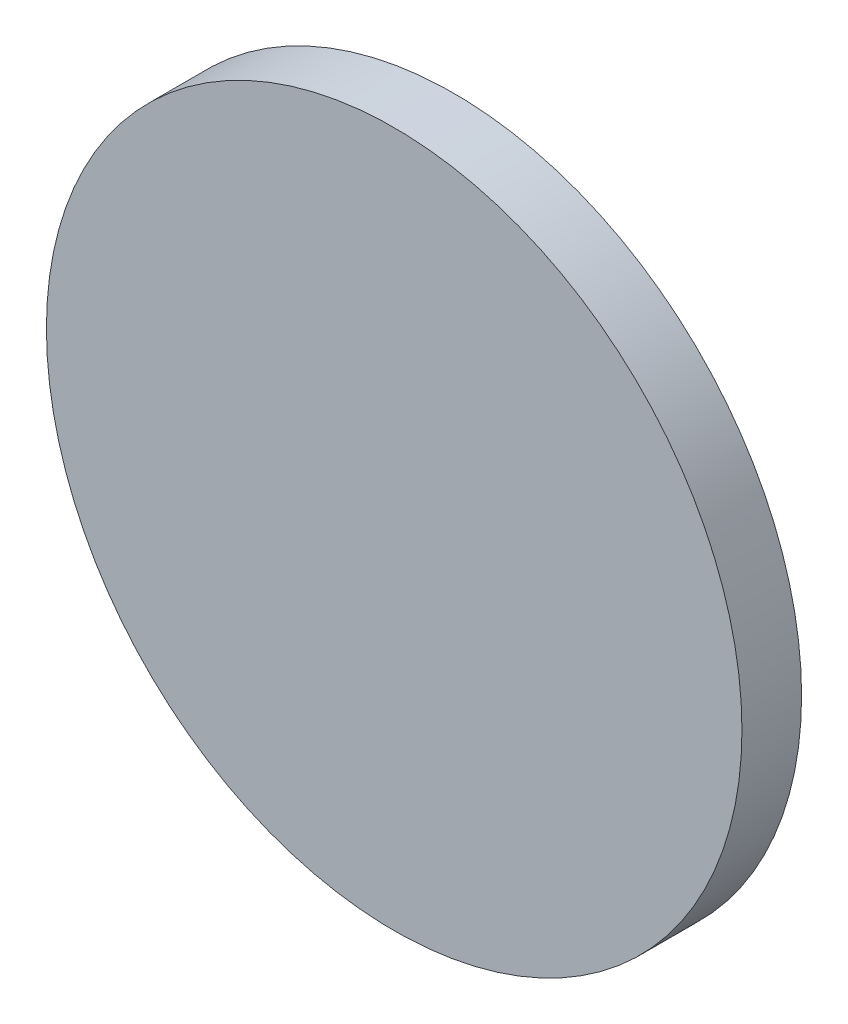
ISO-10303-21;
HEADER;
FILE_DESCRIPTION(('STEP AP214'),'2;1');
FILE_NAME('part.step','',(''),(''),'','','');
FILE_SCHEMA(('AUTOMOTIVE_DESIGN { 1 0 10303 214 1 1 1 1 }'));
ENDSEC;
DATA;
#1=APPLICATION_CONTEXT('core data for automotive mechanical design processes');
#2=APPLICATION_PROTOCOL_DEFINITION('international standard','automotive_design',2000,#1);
#3=PRODUCT_CONTEXT('',#1,'mechanical');
#4=PRODUCT('Part','Part','',(#3));
#5=PRODUCT_RELATED_PRODUCT_CATEGORY('part','',(#4));
#6=PRODUCT_DEFINITION_FORMATION('','',#4);
#7=PRODUCT_DEFINITION_CONTEXT('part definition',#1,'design');
#8=PRODUCT_DEFINITION('design','',#6,#7);
#9=PRODUCT_DEFINITION_SHAPE('','',#8);
#10=(LENGTH_UNIT() NAMED_UNIT(*) SI_UNIT(.MILLI.,.METRE.));
#11=(NAMED_UNIT(*) PLANE_ANGLE_UNIT() SI_UNIT($,.RADIAN.));
#12=(NAMED_UNIT(*) SI_UNIT($,.STERADIAN.) SOLID_ANGLE_UNIT());
#13=UNCERTAINTY_MEASURE_WITH_UNIT(LENGTH_MEASURE(1.E-05),#10,'distance_accuracy_value','');
#14=(GEOMETRIC_REPRESENTATION_CONTEXT(3) GLOBAL_UNCERTAINTY_ASSIGNED_CONTEXT((#13)) GLOBAL_UNIT_ASSIGNED_CONTEXT((#10,
#11,#12)) REPRESENTATION_CONTEXT('',''));
#15=CARTESIAN_POINT('',(0.,0.,0.));
#16=DIRECTION('',(0.,0.,1.));
#17=DIRECTION('',(1.,0.,0.));
#18=AXIS2_PLACEMENT_3D('',#15,#16,#17);
#19=CARTESIAN_POINT('',(1.6129,3.058160006176,0.03429));
#20=DIRECTION('',(0.,0.,1.));
#21=DIRECTION('',(1.,0.,0.));
#22=AXIS2_PLACEMENT_3D('',#19,#20,#21);
#23=PLANE('',#22);
#24=CARTESIAN_POINT('',(1.6129,3.058160006176,0.03429));
#25=DIRECTION('',(0.,0.,1.));
#26=DIRECTION('',(1.,0.,0.));
#27=AXIS2_PLACEMENT_3D('',#24,#25,#26);
#28=CIRCLE('',#27,0.200024667);
#29=CARTESIAN_POINT('',(1.812924667,3.058160006176,0.03429));
#30=VERTEX_POINT('',#29);
#31=EDGE_CURVE('E18',#30,#30,#28,.F.);
#32=ORIENTED_EDGE('',*,*,#31,.F.);
#33=EDGE_LOOP('',(#32));
#34=FACE_BOUND('',#33,.T.);
#35=ADVANCED_FACE('F15',(#34),#23,.T.);
#36=CARTESIAN_POINT('',(1.6129,3.058160006176,0.));
#37=DIRECTION('',(0.,0.,1.));
#38=DIRECTION('',(1.,0.,0.));
#39=AXIS2_PLACEMENT_3D('',#36,#37,#38);
#40=CYLINDRICAL_SURFACE('',#39,0.200024667);
#41=ORIENTED_EDGE('',*,*,#31,.T.);
#42=EDGE_LOOP('',(#41));
#43=FACE_BOUND('',#42,.T.);
#44=CARTESIAN_POINT('',(1.6129,3.058160006176,0.));
#45=DIRECTION('',(0.,0.,1.));
#46=DIRECTION('',(1.,0.,0.));
#47=AXIS2_PLACEMENT_3D('',#44,#45,#46);
#48=CIRCLE('',#47,0.200024667);
#49=CARTESIAN_POINT('',(1.812924667,3.058160006176,0.));
#50=VERTEX_POINT('',#49);
#51=EDGE_CURVE('E10',#50,#50,#48,.F.);
#52=ORIENTED_EDGE('',*,*,#51,.F.);
#53=EDGE_LOOP('',(#52));
#54=FACE_BOUND('',#53,.T.);
#55=ADVANCED_FACE('F27',(#43,#54),#40,.T.);
#56=CARTESIAN_POINT('',(1.6129,3.058160006176,0.));
#57=DIRECTION('',(0.,0.,-1.));
#58=DIRECTION('',(-1.,0.,0.));
#59=AXIS2_PLACEMENT_3D('',#56,#57,#58);
#60=PLANE('',#59);
#61=ORIENTED_EDGE('',*,*,#51,.T.);
#62=EDGE_LOOP('',(#61));
#63=FACE_BOUND('',#62,.T.);
#64=ADVANCED_FACE('F35',(#63),#60,.T.);
#65=CLOSED_SHELL('',(#35,#55,#64));
#66=MANIFOLD_SOLID_BREP('B1',#65);
#67=ADVANCED_BREP_SHAPE_REPRESENTATION('',(#18,#66),#14);
#68=SHAPE_DEFINITION_REPRESENTATION(#9,#67);
ENDSEC;
END-ISO-10303-21;
